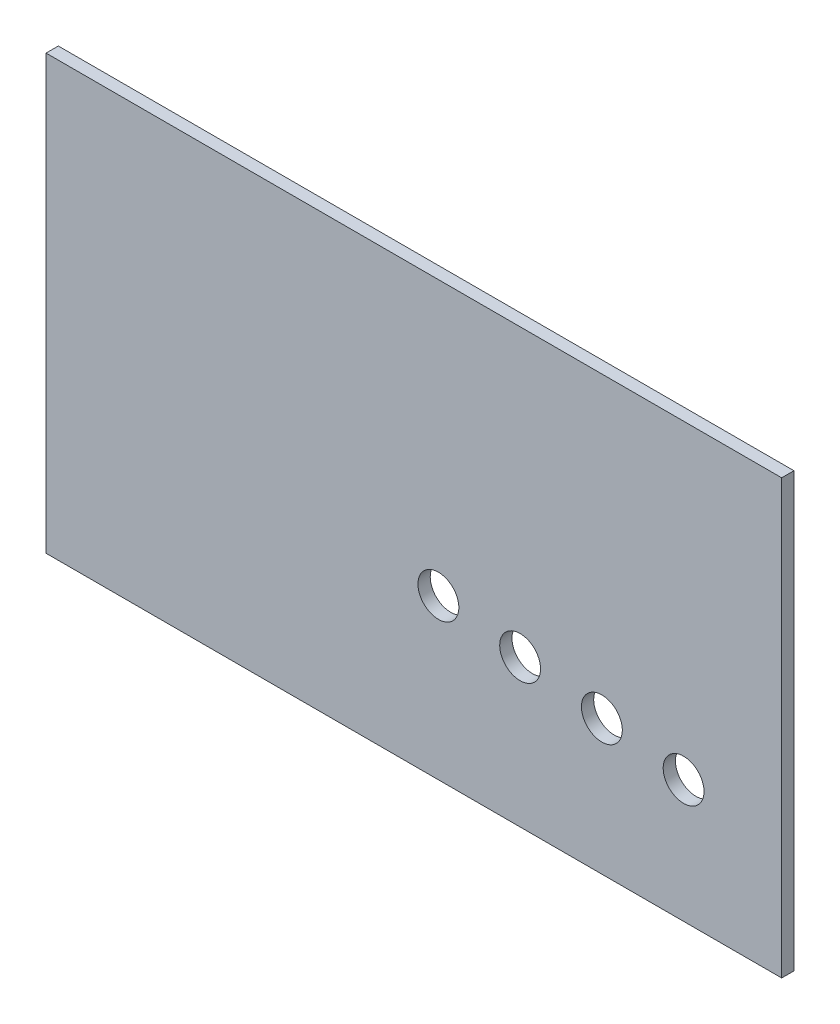
ISO-10303-21;
HEADER;
FILE_DESCRIPTION(('STEP AP214'),'2;1');
FILE_NAME('part.step','',(''),(''),'','','');
FILE_SCHEMA(('AUTOMOTIVE_DESIGN { 1 0 10303 214 1 1 1 1 }'));
ENDSEC;
DATA;
#1=APPLICATION_CONTEXT('core data for automotive mechanical design processes');
#2=APPLICATION_PROTOCOL_DEFINITION('international standard','automotive_design',2000,#1);
#3=PRODUCT_CONTEXT('',#1,'mechanical');
#4=PRODUCT('Part','Part','',(#3));
#5=PRODUCT_RELATED_PRODUCT_CATEGORY('part','',(#4));
#6=PRODUCT_DEFINITION_FORMATION('','',#4);
#7=PRODUCT_DEFINITION_CONTEXT('part definition',#1,'design');
#8=PRODUCT_DEFINITION('design','',#6,#7);
#9=PRODUCT_DEFINITION_SHAPE('','',#8);
#10=(LENGTH_UNIT() NAMED_UNIT(*) SI_UNIT(.MILLI.,.METRE.));
#11=(NAMED_UNIT(*) PLANE_ANGLE_UNIT() SI_UNIT($,.RADIAN.));
#12=(NAMED_UNIT(*) SI_UNIT($,.STERADIAN.) SOLID_ANGLE_UNIT());
#13=UNCERTAINTY_MEASURE_WITH_UNIT(LENGTH_MEASURE(1.E-05),#10,'distance_accuracy_value','');
#14=(GEOMETRIC_REPRESENTATION_CONTEXT(3) GLOBAL_UNCERTAINTY_ASSIGNED_CONTEXT((#13)) GLOBAL_UNIT_ASSIGNED_CONTEXT((#10,
#11,#12)) REPRESENTATION_CONTEXT('',''));
#15=CARTESIAN_POINT('',(0.,0.,0.));
#16=DIRECTION('',(0.,0.,1.));
#17=DIRECTION('',(1.,0.,0.));
#18=AXIS2_PLACEMENT_3D('',#15,#16,#17);
#19=CARTESIAN_POINT('',(0.,0.,15.));
#20=DIRECTION('',(1.,0.,0.));
#21=DIRECTION('',(0.,0.,-1.));
#22=AXIS2_PLACEMENT_3D('',#19,#20,#21);
#23=PLANE('',#22);
#24=DIRECTION('',(0.,-1.,0.));
#25=VECTOR('',#24,1.);
#26=CARTESIAN_POINT('',(0.,0.,0.));
#27=LINE('',#26,#25);
#28=CARTESIAN_POINT('',(0.,530.,0.));
#29=VERTEX_POINT('',#28);
#30=CARTESIAN_POINT('',(0.,0.,0.));
#31=VERTEX_POINT('',#30);
#32=EDGE_CURVE('E96',#29,#31,#27,.T.);
#33=ORIENTED_EDGE('',*,*,#32,.T.);
#34=DIRECTION('',(0.,0.,-1.));
#35=VECTOR('',#34,1.);
#36=CARTESIAN_POINT('',(0.,0.,15.));
#37=LINE('',#36,#35);
#38=CARTESIAN_POINT('',(0.,0.,15.));
#39=VERTEX_POINT('',#38);
#40=EDGE_CURVE('E11',#39,#31,#37,.T.);
#41=ORIENTED_EDGE('',*,*,#40,.F.);
#42=DIRECTION('',(0.,-1.,0.));
#43=VECTOR('',#42,1.);
#44=CARTESIAN_POINT('',(0.,0.,15.));
#45=LINE('',#44,#43);
#46=CARTESIAN_POINT('',(0.,530.,15.));
#47=VERTEX_POINT('',#46);
#48=EDGE_CURVE('E84',#47,#39,#45,.T.);
#49=ORIENTED_EDGE('',*,*,#48,.F.);
#50=DIRECTION('',(0.,0.,-1.));
#51=VECTOR('',#50,1.);
#52=CARTESIAN_POINT('',(0.,530.,15.));
#53=LINE('',#52,#51);
#54=EDGE_CURVE('E92',#47,#29,#53,.T.);
#55=ORIENTED_EDGE('',*,*,#54,.T.);
#56=EDGE_LOOP('',(#33,#41,#49,#55));
#57=FACE_BOUND('',#56,.T.);
#58=ADVANCED_FACE('F33',(#57),#23,.F.);
#59=CARTESIAN_POINT('',(0.,0.,15.));
#60=DIRECTION('',(0.,1.,0.));
#61=DIRECTION('',(0.,0.,1.));
#62=AXIS2_PLACEMENT_3D('',#59,#60,#61);
#63=PLANE('',#62);
#64=DIRECTION('',(1.,0.,0.));
#65=VECTOR('',#64,1.);
#66=CARTESIAN_POINT('',(0.,0.,0.));
#67=LINE('',#66,#65);
#68=CARTESIAN_POINT('',(900.,0.,0.));
#69=VERTEX_POINT('',#68);
#70=EDGE_CURVE('E88',#31,#69,#67,.T.);
#71=ORIENTED_EDGE('',*,*,#70,.T.);
#72=DIRECTION('',(0.,0.,-1.));
#73=VECTOR('',#72,1.);
#74=CARTESIAN_POINT('',(900.,0.,15.));
#75=LINE('',#74,#73);
#76=CARTESIAN_POINT('',(900.,0.,15.));
#77=VERTEX_POINT('',#76);
#78=EDGE_CURVE('E41',#77,#69,#75,.T.);
#79=ORIENTED_EDGE('',*,*,#78,.F.);
#80=DIRECTION('',(1.,0.,0.));
#81=VECTOR('',#80,1.);
#82=CARTESIAN_POINT('',(0.,0.,15.));
#83=LINE('',#82,#81);
#84=EDGE_CURVE('E79',#39,#77,#83,.T.);
#85=ORIENTED_EDGE('',*,*,#84,.F.);
#86=ORIENTED_EDGE('',*,*,#40,.T.);
#87=EDGE_LOOP('',(#71,#79,#85,#86));
#88=FACE_BOUND('',#87,.T.);
#89=ADVANCED_FACE('F87',(#88),#63,.F.);
#90=CARTESIAN_POINT('',(900.,0.,15.));
#91=DIRECTION('',(-1.,0.,0.));
#92=DIRECTION('',(0.,0.,1.));
#93=AXIS2_PLACEMENT_3D('',#90,#91,#92);
#94=PLANE('',#93);
#95=DIRECTION('',(0.,1.,0.));
#96=VECTOR('',#95,1.);
#97=CARTESIAN_POINT('',(900.,0.,0.));
#98=LINE('',#97,#96);
#99=CARTESIAN_POINT('',(900.,530.,0.));
#100=VERTEX_POINT('',#99);
#101=EDGE_CURVE('E66',#69,#100,#98,.T.);
#102=ORIENTED_EDGE('',*,*,#101,.T.);
#103=DIRECTION('',(0.,0.,-1.));
#104=VECTOR('',#103,1.);
#105=CARTESIAN_POINT('',(900.,530.,15.));
#106=LINE('',#105,#104);
#107=CARTESIAN_POINT('',(900.,530.,15.));
#108=VERTEX_POINT('',#107);
#109=EDGE_CURVE('E89',#108,#100,#106,.T.);
#110=ORIENTED_EDGE('',*,*,#109,.F.);
#111=DIRECTION('',(0.,1.,0.));
#112=VECTOR('',#111,1.);
#113=CARTESIAN_POINT('',(900.,0.,15.));
#114=LINE('',#113,#112);
#115=EDGE_CURVE('E82',#77,#108,#114,.T.);
#116=ORIENTED_EDGE('',*,*,#115,.F.);
#117=ORIENTED_EDGE('',*,*,#78,.T.);
#118=EDGE_LOOP('',(#102,#110,#116,#117));
#119=FACE_BOUND('',#118,.T.);
#120=ADVANCED_FACE('F90',(#119),#94,.F.);
#121=CARTESIAN_POINT('',(0.,530.,15.));
#122=DIRECTION('',(0.,-1.,0.));
#123=DIRECTION('',(0.,0.,-1.));
#124=AXIS2_PLACEMENT_3D('',#121,#122,#123);
#125=PLANE('',#124);
#126=DIRECTION('',(-1.,0.,0.));
#127=VECTOR('',#126,1.);
#128=CARTESIAN_POINT('',(0.,530.,0.));
#129=LINE('',#128,#127);
#130=EDGE_CURVE('E72',#100,#29,#129,.T.);
#131=ORIENTED_EDGE('',*,*,#130,.T.);
#132=ORIENTED_EDGE('',*,*,#54,.F.);
#133=DIRECTION('',(-1.,0.,0.));
#134=VECTOR('',#133,1.);
#135=CARTESIAN_POINT('',(0.,530.,15.));
#136=LINE('',#135,#134);
#137=EDGE_CURVE('E49',#108,#47,#136,.T.);
#138=ORIENTED_EDGE('',*,*,#137,.F.);
#139=ORIENTED_EDGE('',*,*,#109,.T.);
#140=EDGE_LOOP('',(#131,#132,#138,#139));
#141=FACE_BOUND('',#140,.T.);
#142=ADVANCED_FACE('F104',(#141),#125,.F.);
#143=CARTESIAN_POINT('',(0.,0.,15.));
#144=DIRECTION('',(0.,0.,-1.));
#145=DIRECTION('',(-1.,0.,0.));
#146=AXIS2_PLACEMENT_3D('',#143,#144,#145);
#147=PLANE('',#146);
#148=CARTESIAN_POINT('',(780.,150.,15.));
#149=DIRECTION('',(0.,0.,-1.));
#150=DIRECTION('',(-1.,0.,0.));
#151=AXIS2_PLACEMENT_3D('',#148,#149,#150);
#152=CIRCLE('',#151,25.);
#153=CARTESIAN_POINT('',(755.,150.,15.));
#154=VERTEX_POINT('',#153);
#155=EDGE_CURVE('E99',#154,#154,#152,.T.);
#156=ORIENTED_EDGE('',*,*,#155,.T.);
#157=EDGE_LOOP('',(#156));
#158=FACE_BOUND('',#157,.T.);
#159=CARTESIAN_POINT('',(680.,165.,15.));
#160=DIRECTION('',(0.,0.,-1.));
#161=DIRECTION('',(-1.,0.,0.));
#162=AXIS2_PLACEMENT_3D('',#159,#160,#161);
#163=CIRCLE('',#162,25.);
#164=CARTESIAN_POINT('',(655.,165.,15.));
#165=VERTEX_POINT('',#164);
#166=EDGE_CURVE('E125',#165,#165,#163,.T.);
#167=ORIENTED_EDGE('',*,*,#166,.T.);
#168=EDGE_LOOP('',(#167));
#169=FACE_BOUND('',#168,.T.);
#170=CARTESIAN_POINT('',(580.,180.,15.));
#171=DIRECTION('',(0.,0.,-1.));
#172=DIRECTION('',(-1.,0.,0.));
#173=AXIS2_PLACEMENT_3D('',#170,#171,#172);
#174=CIRCLE('',#173,25.);
#175=CARTESIAN_POINT('',(555.,180.,15.));
#176=VERTEX_POINT('',#175);
#177=EDGE_CURVE('E119',#176,#176,#174,.T.);
#178=ORIENTED_EDGE('',*,*,#177,.T.);
#179=EDGE_LOOP('',(#178));
#180=FACE_BOUND('',#179,.T.);
#181=CARTESIAN_POINT('',(480.,195.,15.));
#182=DIRECTION('',(0.,0.,-1.));
#183=DIRECTION('',(-1.,0.,0.));
#184=AXIS2_PLACEMENT_3D('',#181,#182,#183);
#185=CIRCLE('',#184,25.);
#186=CARTESIAN_POINT('',(455.,195.,15.));
#187=VERTEX_POINT('',#186);
#188=EDGE_CURVE('E113',#187,#187,#185,.T.);
#189=ORIENTED_EDGE('',*,*,#188,.T.);
#190=EDGE_LOOP('',(#189));
#191=FACE_BOUND('',#190,.T.);
#192=ORIENTED_EDGE('',*,*,#48,.T.);
#193=ORIENTED_EDGE('',*,*,#84,.T.);
#194=ORIENTED_EDGE('',*,*,#115,.T.);
#195=ORIENTED_EDGE('',*,*,#137,.T.);
#196=EDGE_LOOP('',(#192,#193,#194,#195));
#197=FACE_BOUND('',#196,.T.);
#198=ADVANCED_FACE('F80',(#158,#169,#180,#191,#197),#147,.F.);
#199=CARTESIAN_POINT('',(0.,0.,0.));
#200=DIRECTION('',(0.,0.,-1.));
#201=DIRECTION('',(-1.,0.,0.));
#202=AXIS2_PLACEMENT_3D('',#199,#200,#201);
#203=PLANE('',#202);
#204=CARTESIAN_POINT('',(780.,150.,0.));
#205=DIRECTION('',(0.,0.,-1.));
#206=DIRECTION('',(-1.,0.,0.));
#207=AXIS2_PLACEMENT_3D('',#204,#205,#206);
#208=CIRCLE('',#207,25.);
#209=CARTESIAN_POINT('',(755.,150.,0.));
#210=VERTEX_POINT('',#209);
#211=EDGE_CURVE('E128',#210,#210,#208,.T.);
#212=ORIENTED_EDGE('',*,*,#211,.F.);
#213=EDGE_LOOP('',(#212));
#214=FACE_BOUND('',#213,.T.);
#215=CARTESIAN_POINT('',(680.,165.,0.));
#216=DIRECTION('',(0.,0.,-1.));
#217=DIRECTION('',(-1.,0.,0.));
#218=AXIS2_PLACEMENT_3D('',#215,#216,#217);
#219=CIRCLE('',#218,25.);
#220=CARTESIAN_POINT('',(655.,165.,0.));
#221=VERTEX_POINT('',#220);
#222=EDGE_CURVE('E122',#221,#221,#219,.T.);
#223=ORIENTED_EDGE('',*,*,#222,.F.);
#224=EDGE_LOOP('',(#223));
#225=FACE_BOUND('',#224,.T.);
#226=CARTESIAN_POINT('',(580.,180.,0.));
#227=DIRECTION('',(0.,0.,-1.));
#228=DIRECTION('',(-1.,0.,0.));
#229=AXIS2_PLACEMENT_3D('',#226,#227,#228);
#230=CIRCLE('',#229,25.);
#231=CARTESIAN_POINT('',(555.,180.,0.));
#232=VERTEX_POINT('',#231);
#233=EDGE_CURVE('E116',#232,#232,#230,.T.);
#234=ORIENTED_EDGE('',*,*,#233,.F.);
#235=EDGE_LOOP('',(#234));
#236=FACE_BOUND('',#235,.T.);
#237=CARTESIAN_POINT('',(480.,195.,0.));
#238=DIRECTION('',(0.,0.,-1.));
#239=DIRECTION('',(-1.,0.,0.));
#240=AXIS2_PLACEMENT_3D('',#237,#238,#239);
#241=CIRCLE('',#240,25.);
#242=CARTESIAN_POINT('',(455.,195.,0.));
#243=VERTEX_POINT('',#242);
#244=EDGE_CURVE('E110',#243,#243,#241,.T.);
#245=ORIENTED_EDGE('',*,*,#244,.F.);
#246=EDGE_LOOP('',(#245));
#247=FACE_BOUND('',#246,.T.);
#248=ORIENTED_EDGE('',*,*,#32,.F.);
#249=ORIENTED_EDGE('',*,*,#130,.F.);
#250=ORIENTED_EDGE('',*,*,#101,.F.);
#251=ORIENTED_EDGE('',*,*,#70,.F.);
#252=EDGE_LOOP('',(#248,#249,#250,#251));
#253=FACE_BOUND('',#252,.T.);
#254=ADVANCED_FACE('F107',(#214,#225,#236,#247,#253),#203,.T.);
#255=CARTESIAN_POINT('',(480.,195.,15.));
#256=DIRECTION('',(0.,0.,-1.));
#257=DIRECTION('',(-1.,0.,0.));
#258=AXIS2_PLACEMENT_3D('',#255,#256,#257);
#259=CYLINDRICAL_SURFACE('',#258,25.);
#260=ORIENTED_EDGE('',*,*,#188,.F.);
#261=EDGE_LOOP('',(#260));
#262=FACE_BOUND('',#261,.T.);
#263=ORIENTED_EDGE('',*,*,#244,.T.);
#264=EDGE_LOOP('',(#263));
#265=FACE_BOUND('',#264,.T.);
#266=ADVANCED_FACE('F145',(#262,#265),#259,.F.);
#267=CARTESIAN_POINT('',(580.,180.,15.));
#268=DIRECTION('',(0.,0.,-1.));
#269=DIRECTION('',(-1.,0.,0.));
#270=AXIS2_PLACEMENT_3D('',#267,#268,#269);
#271=CYLINDRICAL_SURFACE('',#270,25.);
#272=ORIENTED_EDGE('',*,*,#177,.F.);
#273=EDGE_LOOP('',(#272));
#274=FACE_BOUND('',#273,.T.);
#275=ORIENTED_EDGE('',*,*,#233,.T.);
#276=EDGE_LOOP('',(#275));
#277=FACE_BOUND('',#276,.T.);
#278=ADVANCED_FACE('F154',(#274,#277),#271,.F.);
#279=CARTESIAN_POINT('',(680.,165.,15.));
#280=DIRECTION('',(0.,0.,-1.));
#281=DIRECTION('',(-1.,0.,0.));
#282=AXIS2_PLACEMENT_3D('',#279,#280,#281);
#283=CYLINDRICAL_SURFACE('',#282,25.);
#284=ORIENTED_EDGE('',*,*,#166,.F.);
#285=EDGE_LOOP('',(#284));
#286=FACE_BOUND('',#285,.T.);
#287=ORIENTED_EDGE('',*,*,#222,.T.);
#288=EDGE_LOOP('',(#287));
#289=FACE_BOUND('',#288,.T.);
#290=ADVANCED_FACE('F139',(#286,#289),#283,.F.);
#291=CARTESIAN_POINT('',(780.,150.,15.));
#292=DIRECTION('',(0.,0.,-1.));
#293=DIRECTION('',(-1.,0.,0.));
#294=AXIS2_PLACEMENT_3D('',#291,#292,#293);
#295=CYLINDRICAL_SURFACE('',#294,25.);
#296=ORIENTED_EDGE('',*,*,#155,.F.);
#297=EDGE_LOOP('',(#296));
#298=FACE_BOUND('',#297,.T.);
#299=ORIENTED_EDGE('',*,*,#211,.T.);
#300=EDGE_LOOP('',(#299));
#301=FACE_BOUND('',#300,.T.);
#302=ADVANCED_FACE('F136',(#298,#301),#295,.F.);
#303=CLOSED_SHELL('',(#58,#89,#120,#142,#198,#254,#266,#278,#290,#302));
#304=MANIFOLD_SOLID_BREP('B2',#303);
#305=ADVANCED_BREP_SHAPE_REPRESENTATION('',(#18,#304),#14);
#306=SHAPE_DEFINITION_REPRESENTATION(#9,#305);
ENDSEC;
END-ISO-10303-21;
